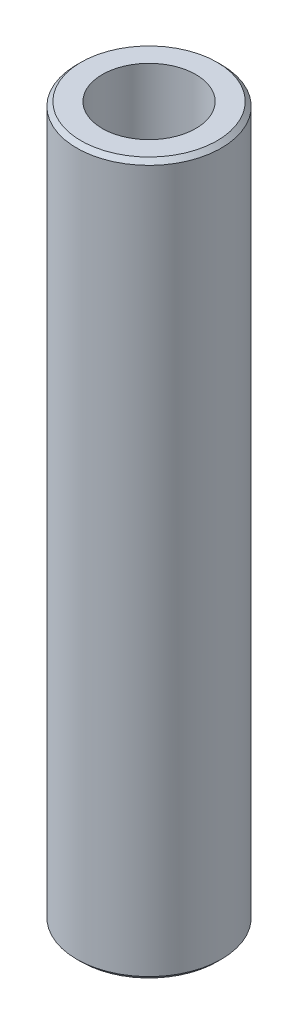
ISO-10303-21;
HEADER;
FILE_DESCRIPTION(('STEP AP214'),'2;1');
FILE_NAME('part.step','',(''),(''),'','','');
FILE_SCHEMA(('AUTOMOTIVE_DESIGN { 1 0 10303 214 1 1 1 1 }'));
ENDSEC;
DATA;
#1=APPLICATION_CONTEXT('core data for automotive mechanical design processes');
#2=APPLICATION_PROTOCOL_DEFINITION('international standard','automotive_design',2000,#1);
#3=PRODUCT_CONTEXT('',#1,'mechanical');
#4=PRODUCT('Part','Part','',(#3));
#5=PRODUCT_RELATED_PRODUCT_CATEGORY('part','',(#4));
#6=PRODUCT_DEFINITION_FORMATION('','',#4);
#7=PRODUCT_DEFINITION_CONTEXT('part definition',#1,'design');
#8=PRODUCT_DEFINITION('design','',#6,#7);
#9=PRODUCT_DEFINITION_SHAPE('','',#8);
#10=(LENGTH_UNIT() NAMED_UNIT(*) SI_UNIT(.MILLI.,.METRE.));
#11=(NAMED_UNIT(*) PLANE_ANGLE_UNIT() SI_UNIT($,.RADIAN.));
#12=(NAMED_UNIT(*) SI_UNIT($,.STERADIAN.) SOLID_ANGLE_UNIT());
#13=UNCERTAINTY_MEASURE_WITH_UNIT(LENGTH_MEASURE(1.E-05),#10,'distance_accuracy_value','');
#14=(GEOMETRIC_REPRESENTATION_CONTEXT(3) GLOBAL_UNCERTAINTY_ASSIGNED_CONTEXT((#13)) GLOBAL_UNIT_ASSIGNED_CONTEXT((#10,
#11,#12)) REPRESENTATION_CONTEXT('',''));
#15=CARTESIAN_POINT('',(0.,0.,0.));
#16=DIRECTION('',(0.,0.,1.));
#17=DIRECTION('',(1.,0.,0.));
#18=AXIS2_PLACEMENT_3D('',#15,#16,#17);
#19=CARTESIAN_POINT('',(0.,393.492594540854,0.));
#20=DIRECTION('',(0.,-1.,0.));
#21=DIRECTION('',(0.,0.,-1.));
#22=AXIS2_PLACEMENT_3D('',#19,#20,#21);
#23=CYLINDRICAL_SURFACE('',#22,40.);
#24=CARTESIAN_POINT('',(0.,391.145544931576,0.));
#25=DIRECTION('',(0.,1.,0.));
#26=DIRECTION('',(0.,0.,1.));
#27=AXIS2_PLACEMENT_3D('',#24,#25,#26);
#28=CIRCLE('',#27,40.);
#29=CARTESIAN_POINT('',(0.,391.145544931576,-40.));
#30=VERTEX_POINT('',#29);
#31=EDGE_CURVE('E50',#30,#30,#28,.F.);
#32=ORIENTED_EDGE('',*,*,#31,.T.);
#33=EDGE_LOOP('',(#32));
#34=FACE_BOUND('',#33,.T.);
#35=CARTESIAN_POINT('',(0.,2.3470496092779,0.));
#36=DIRECTION('',(0.,1.,0.));
#37=DIRECTION('',(0.,0.,1.));
#38=AXIS2_PLACEMENT_3D('',#35,#36,#37);
#39=CIRCLE('',#38,40.);
#40=CARTESIAN_POINT('',(0.,2.3470496092779,40.));
#41=VERTEX_POINT('',#40);
#42=EDGE_CURVE('E51',#41,#41,#39,.T.);
#43=ORIENTED_EDGE('',*,*,#42,.T.);
#44=EDGE_LOOP('',(#43));
#45=FACE_BOUND('',#44,.T.);
#46=ADVANCED_FACE('F39',(#34,#45),#23,.T.);
#47=CARTESIAN_POINT('',(0.,393.492594540854,0.));
#48=DIRECTION('',(0.,1.,0.));
#49=DIRECTION('',(0.,0.,1.));
#50=AXIS2_PLACEMENT_3D('',#47,#48,#49);
#51=PLANE('',#50);
#52=CARTESIAN_POINT('',(0.,393.492594540854,0.));
#53=DIRECTION('',(0.,1.,0.));
#54=DIRECTION('',(0.,0.,1.));
#55=AXIS2_PLACEMENT_3D('',#52,#53,#54);
#56=CIRCLE('',#55,37.652950390722);
#57=CARTESIAN_POINT('',(0.,393.492594540854,-37.6529503907221));
#58=VERTEX_POINT('',#57);
#59=EDGE_CURVE('E54',#58,#58,#56,.T.);
#60=ORIENTED_EDGE('',*,*,#59,.T.);
#61=EDGE_LOOP('',(#60));
#62=FACE_BOUND('',#61,.T.);
#63=CARTESIAN_POINT('',(0.,393.492594540854,0.));
#64=DIRECTION('',(0.,1.,0.));
#65=DIRECTION('',(0.,0.,1.));
#66=AXIS2_PLACEMENT_3D('',#63,#64,#65);
#67=CIRCLE('',#66,25.8936053292283);
#68=CARTESIAN_POINT('',(0.,393.492594540854,25.8936053292283));
#69=VERTEX_POINT('',#68);
#70=EDGE_CURVE('E58',#69,#69,#67,.T.);
#71=ORIENTED_EDGE('',*,*,#70,.F.);
#72=EDGE_LOOP('',(#71));
#73=FACE_BOUND('',#72,.T.);
#74=ADVANCED_FACE('F69',(#62,#73),#51,.T.);
#75=CARTESIAN_POINT('',(0.,0.,0.));
#76=DIRECTION('',(0.,1.,0.));
#77=DIRECTION('',(0.,0.,1.));
#78=AXIS2_PLACEMENT_3D('',#75,#76,#77);
#79=PLANE('',#78);
#80=CARTESIAN_POINT('',(0.,0.,0.));
#81=DIRECTION('',(0.,1.,0.));
#82=DIRECTION('',(0.,0.,1.));
#83=AXIS2_PLACEMENT_3D('',#80,#81,#82);
#84=CIRCLE('',#83,37.652950390722);
#85=CARTESIAN_POINT('',(0.,0.,37.652950390722));
#86=VERTEX_POINT('',#85);
#87=EDGE_CURVE('E10',#86,#86,#84,.F.);
#88=ORIENTED_EDGE('',*,*,#87,.T.);
#89=EDGE_LOOP('',(#88));
#90=FACE_BOUND('',#89,.T.);
#91=CARTESIAN_POINT('',(0.,0.,0.));
#92=DIRECTION('',(0.,1.,0.));
#93=DIRECTION('',(0.,0.,1.));
#94=AXIS2_PLACEMENT_3D('',#91,#92,#93);
#95=CIRCLE('',#94,25.8936053292283);
#96=CARTESIAN_POINT('',(0.,0.,25.8936053292283));
#97=VERTEX_POINT('',#96);
#98=EDGE_CURVE('E63',#97,#97,#95,.T.);
#99=ORIENTED_EDGE('',*,*,#98,.T.);
#100=EDGE_LOOP('',(#99));
#101=FACE_BOUND('',#100,.T.);
#102=ADVANCED_FACE('F75',(#90,#101),#79,.F.);
#103=CARTESIAN_POINT('',(0.,393.492594540854,0.));
#104=DIRECTION('',(0.,-1.,0.));
#105=DIRECTION('',(0.,0.,-1.));
#106=AXIS2_PLACEMENT_3D('',#103,#104,#105);
#107=CYLINDRICAL_SURFACE('',#106,25.8936053292283);
#108=ORIENTED_EDGE('',*,*,#70,.T.);
#109=EDGE_LOOP('',(#108));
#110=FACE_BOUND('',#109,.T.);
#111=ORIENTED_EDGE('',*,*,#98,.F.);
#112=EDGE_LOOP('',(#111));
#113=FACE_BOUND('',#112,.T.);
#114=ADVANCED_FACE('F70',(#110,#113),#107,.F.);
#115=CARTESIAN_POINT('',(0.,393.492594540854,0.));
#116=DIRECTION('',(0.,-1.,0.));
#117=DIRECTION('',(0.,0.,-1.));
#118=AXIS2_PLACEMENT_3D('',#115,#116,#117);
#119=CONICAL_SURFACE('',#118,37.652950390722,0.785398163397453);
#120=CARTESIAN_POINT('',(0.,391.145544931576,-40.));
#121=CARTESIAN_POINT('',(0.,391.169993365006,-39.97555156657));
#122=CARTESIAN_POINT('',(0.,391.194441798436,-39.9511031331401));
#123=CARTESIAN_POINT('',(0.,391.243338665296,-39.9022062662801));
#124=CARTESIAN_POINT('',(0.,391.267787098726,-39.8777578328501));
#125=CARTESIAN_POINT('',(0.,391.316683965586,-39.8288609659902));
#126=CARTESIAN_POINT('',(0.,391.341132399016,-39.8044125325602));
#127=CARTESIAN_POINT('',(0.,391.390029265876,-39.7555156657002));
#128=CARTESIAN_POINT('',(0.,391.414477699306,-39.7310672322703));
#129=CARTESIAN_POINT('',(0.,391.463374566166,-39.6821703654103));
#130=CARTESIAN_POINT('',(0.,391.487822999596,-39.6577219319803));
#131=CARTESIAN_POINT('',(0.,391.536719866456,-39.6088250651204));
#132=CARTESIAN_POINT('',(0.,391.561168299886,-39.5843766316904));
#133=CARTESIAN_POINT('',(0.,391.610065166746,-39.5354797648304));
#134=CARTESIAN_POINT('',(0.,391.634513600176,-39.5110313314005));
#135=CARTESIAN_POINT('',(0.,391.683410467035,-39.4621344645405));
#136=CARTESIAN_POINT('',(0.,391.707858900466,-39.4376860311105));
#137=CARTESIAN_POINT('',(0.,391.756755767325,-39.3887891642506));
#138=CARTESIAN_POINT('',(0.,391.781204200755,-39.3643407308206));
#139=CARTESIAN_POINT('',(0.,391.830101067615,-39.3154438639606));
#140=CARTESIAN_POINT('',(0.,391.854549501045,-39.2909954305306));
#141=CARTESIAN_POINT('',(0.,391.903446367905,-39.2420985636707));
#142=CARTESIAN_POINT('',(0.,391.927894801335,-39.2176501302407));
#143=CARTESIAN_POINT('',(0.,391.976791668195,-39.1687532633807));
#144=CARTESIAN_POINT('',(0.,392.001240101625,-39.1443048299508));
#145=CARTESIAN_POINT('',(0.,392.050136968485,-39.0954079630908));
#146=CARTESIAN_POINT('',(0.,392.074585401915,-39.0709595296608));
#147=CARTESIAN_POINT('',(0.,392.123482268775,-39.0220626628009));
#148=CARTESIAN_POINT('',(0.,392.147930702205,-38.9976142293709));
#149=CARTESIAN_POINT('',(0.,392.196827569065,-38.9487173625109));
#150=CARTESIAN_POINT('',(0.,392.221276002495,-38.924268929081));
#151=CARTESIAN_POINT('',(0.,392.270172869355,-38.875372062221));
#152=CARTESIAN_POINT('',(0.,392.294621302785,-38.850923628791));
#153=CARTESIAN_POINT('',(0.,392.343518169645,-38.8020267619311));
#154=CARTESIAN_POINT('',(0.,392.367966603075,-38.7775783285011));
#155=CARTESIAN_POINT('',(0.,392.416863469935,-38.7286814616411));
#156=CARTESIAN_POINT('',(0.,392.441311903365,-38.7042330282111));
#157=CARTESIAN_POINT('',(0.,392.490208770225,-38.6553361613512));
#158=CARTESIAN_POINT('',(0.,392.514657203655,-38.6308877279212));
#159=CARTESIAN_POINT('',(0.,392.563554070515,-38.5819908610613));
#160=CARTESIAN_POINT('',(0.,392.588002503945,-38.5575424276313));
#161=CARTESIAN_POINT('',(0.,392.636899370805,-38.5086455607713));
#162=CARTESIAN_POINT('',(0.,392.661347804235,-38.4841971273413));
#163=CARTESIAN_POINT('',(0.,392.710244671095,-38.4353002604814));
#164=CARTESIAN_POINT('',(0.,392.734693104525,-38.4108518270514));
#165=CARTESIAN_POINT('',(0.,392.783589971385,-38.3619549601914));
#166=CARTESIAN_POINT('',(0.,392.808038404815,-38.3375065267615));
#167=CARTESIAN_POINT('',(0.,392.856935271675,-38.2886096599015));
#168=CARTESIAN_POINT('',(0.,392.881383705104,-38.2641612264715));
#169=CARTESIAN_POINT('',(0.,392.930280571964,-38.2152643596116));
#170=CARTESIAN_POINT('',(0.,392.954729005394,-38.1908159261816));
#171=CARTESIAN_POINT('',(0.,393.003625872254,-38.1419190593216));
#172=CARTESIAN_POINT('',(0.,393.028074305684,-38.1174706258916));
#173=CARTESIAN_POINT('',(0.,393.076971172544,-38.0685737590317));
#174=CARTESIAN_POINT('',(0.,393.101419605974,-38.0441253256017));
#175=CARTESIAN_POINT('',(0.,393.150316472834,-37.9952284587418));
#176=CARTESIAN_POINT('',(0.,393.174764906264,-37.9707800253118));
#177=CARTESIAN_POINT('',(0.,393.223661773124,-37.9218831584518));
#178=CARTESIAN_POINT('',(0.,393.248110206554,-37.8974347250218));
#179=CARTESIAN_POINT('',(0.,393.297007073414,-37.8485378581619));
#180=CARTESIAN_POINT('',(0.,393.321455506844,-37.8240894247319));
#181=CARTESIAN_POINT('',(0.,393.370352373704,-37.7751925578719));
#182=CARTESIAN_POINT('',(0.,393.394800807134,-37.750744124442));
#183=CARTESIAN_POINT('',(0.,393.443697673994,-37.701847257582));
#184=CARTESIAN_POINT('',(0.,393.468146107424,-37.677398824152));
#185=CARTESIAN_POINT('',(0.,393.492594540854,-37.6529503907221));
#186=B_SPLINE_CURVE_WITH_KNOTS('',3,(#120,#121,#122,#123,#124,#125,#126,#127,#128,#129,#130,
#131,#132,#133,#134,#135,#136,#137,#138,#139,#140,#141,#142,#143,#144,#145,#146,#147,#148,#149,
#150,#151,#152,#153,#154,#155,#156,#157,#158,#159,#160,#161,#162,#163,#164,#165,#166,#167,#168,
#169,#170,#171,#172,#173,#174,#175,#176,#177,#178,#179,#180,#181,#182,#183,#184,#185),
.UNSPECIFIED.,.F.,.F.,(4,2,2,2,2,2,2,2,2,2,2,2,2,2,2,2,2,2,2,2,2,2,2,2,2,2,2,2,2,2,2,2,4),(0.,
0.103725918406333,0.20745183681271,0.311177755219042,0.414903673625414,0.518629592031752,
0.622355510438124,0.726081428844456,0.829807347250833,0.933533265657166,1.03725918406354,
1.14098510246988,1.24471102087625,1.34843693928258,1.45216285768896,1.55588877609529,
1.65961469450166,1.76334061290804,1.86706653131437,1.97079244972075,2.07451836812708,
2.17824428653345,2.28197020493979,2.38569612334616,2.48942204175249,2.59314796015887,
2.6968738785652,2.80059979697158,2.90432571537791,3.00805163378429,3.11177755219062,
3.215503470597,3.31922938900337),.UNSPECIFIED.);
#187=EDGE_CURVE('BSEAM81',#30,#58,#186,.T.);
#188=ORIENTED_EDGE('',*,*,#31,.F.);
#189=ORIENTED_EDGE('',*,*,#59,.F.);
#190=ORIENTED_EDGE('',*,*,#187,.T.);
#191=ORIENTED_EDGE('',*,*,#187,.F.);
#192=EDGE_LOOP('',(#188,#190,#189,#191));
#193=FACE_BOUND('',#192,.T.);
#194=ADVANCED_FACE('F81',(#193),#119,.T.);
#195=CARTESIAN_POINT('',(0.,2.3470496092779,0.));
#196=DIRECTION('',(0.,1.,0.));
#197=DIRECTION('',(0.,0.,1.));
#198=AXIS2_PLACEMENT_3D('',#195,#196,#197);
#199=CONICAL_SURFACE('',#198,40.,0.785398163397465);
#200=ORIENTED_EDGE('',*,*,#87,.F.);
#201=EDGE_LOOP('',(#200));
#202=FACE_BOUND('',#201,.T.);
#203=ORIENTED_EDGE('',*,*,#42,.F.);
#204=EDGE_LOOP('',(#203));
#205=FACE_BOUND('',#204,.T.);
#206=ADVANCED_FACE('F45',(#202,#205),#199,.T.);
#207=CLOSED_SHELL('',(#46,#74,#102,#114,#194,#206));
#208=MANIFOLD_SOLID_BREP('B2',#207);
#209=ADVANCED_BREP_SHAPE_REPRESENTATION('',(#18,#208),#14);
#210=SHAPE_DEFINITION_REPRESENTATION(#9,#209);
ENDSEC;
END-ISO-10303-21;
